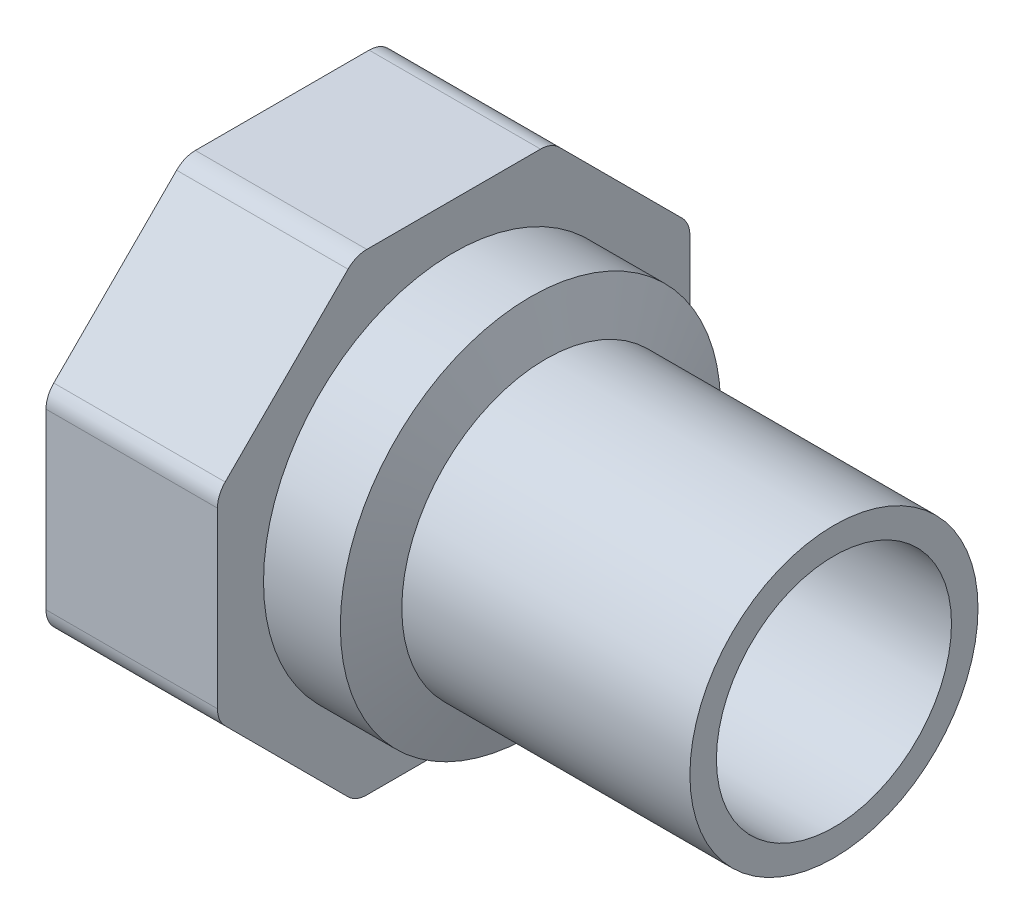
ISO-10303-21;
HEADER;
FILE_DESCRIPTION(('STEP AP214'),'2;1');
FILE_NAME('part.step','',(''),(''),'','','');
FILE_SCHEMA(('AUTOMOTIVE_DESIGN { 1 0 10303 214 1 1 1 1 }'));
ENDSEC;
DATA;
#1=APPLICATION_CONTEXT('core data for automotive mechanical design processes');
#2=APPLICATION_PROTOCOL_DEFINITION('international standard','automotive_design',2000,#1);
#3=PRODUCT_CONTEXT('',#1,'mechanical');
#4=PRODUCT('Part','Part','',(#3));
#5=PRODUCT_RELATED_PRODUCT_CATEGORY('part','',(#4));
#6=PRODUCT_DEFINITION_FORMATION('','',#4);
#7=PRODUCT_DEFINITION_CONTEXT('part definition',#1,'design');
#8=PRODUCT_DEFINITION('design','',#6,#7);
#9=PRODUCT_DEFINITION_SHAPE('','',#8);
#10=(LENGTH_UNIT() NAMED_UNIT(*) SI_UNIT(.MILLI.,.METRE.));
#11=(NAMED_UNIT(*) PLANE_ANGLE_UNIT() SI_UNIT($,.RADIAN.));
#12=(NAMED_UNIT(*) SI_UNIT($,.STERADIAN.) SOLID_ANGLE_UNIT());
#13=UNCERTAINTY_MEASURE_WITH_UNIT(LENGTH_MEASURE(1.E-05),#10,'distance_accuracy_value','');
#14=(GEOMETRIC_REPRESENTATION_CONTEXT(3) GLOBAL_UNCERTAINTY_ASSIGNED_CONTEXT((#13)) GLOBAL_UNIT_ASSIGNED_CONTEXT((#10,
#11,#12)) REPRESENTATION_CONTEXT('',''));
#15=CARTESIAN_POINT('',(0.,0.,0.));
#16=DIRECTION('',(0.,0.,1.));
#17=DIRECTION('',(1.,0.,0.));
#18=AXIS2_PLACEMENT_3D('',#15,#16,#17);
#19=CARTESIAN_POINT('',(-25.,0.,0.));
#20=DIRECTION('',(-1.,0.,0.));
#21=DIRECTION('',(0.,0.,1.));
#22=AXIS2_PLACEMENT_3D('',#19,#20,#21);
#23=CYLINDRICAL_SURFACE('',#22,12.5);
#24=CARTESIAN_POINT('',(-25.,0.,0.));
#25=DIRECTION('',(1.,0.,0.));
#26=DIRECTION('',(0.,1.,0.));
#27=AXIS2_PLACEMENT_3D('',#24,#25,#26);
#28=CIRCLE('',#27,12.5);
#29=CARTESIAN_POINT('',(-25.,12.5,0.));
#30=VERTEX_POINT('',#29);
#31=EDGE_CURVE('E193',#30,#30,#28,.F.);
#32=ORIENTED_EDGE('',*,*,#31,.F.);
#33=EDGE_LOOP('',(#32));
#34=FACE_BOUND('',#33,.T.);
#35=CARTESIAN_POINT('',(0.,0.,0.));
#36=DIRECTION('',(-1.,0.,0.));
#37=DIRECTION('',(0.,0.,1.));
#38=AXIS2_PLACEMENT_3D('',#35,#36,#37);
#39=CIRCLE('',#38,12.5);
#40=CARTESIAN_POINT('',(0.,0.,12.5));
#41=VERTEX_POINT('',#40);
#42=EDGE_CURVE('E18',#41,#41,#39,.F.);
#43=ORIENTED_EDGE('',*,*,#42,.F.);
#44=EDGE_LOOP('',(#43));
#45=FACE_BOUND('',#44,.T.);
#46=ADVANCED_FACE('F15',(#34,#45),#23,.T.);
#47=CARTESIAN_POINT('',(-25.,0.,0.));
#48=DIRECTION('',(-1.,0.,0.));
#49=DIRECTION('',(0.,0.,1.));
#50=AXIS2_PLACEMENT_3D('',#47,#48,#49);
#51=CONICAL_SURFACE('',#50,12.5,1.24904577239826);
#52=CARTESIAN_POINT('',(-26.3333333333333,0.,0.));
#53=DIRECTION('',(-1.,0.,0.));
#54=DIRECTION('',(0.,1.,0.));
#55=AXIS2_PLACEMENT_3D('',#52,#53,#54);
#56=CIRCLE('',#55,16.5);
#57=CARTESIAN_POINT('',(-26.3333333333333,16.5,0.));
#58=VERTEX_POINT('',#57);
#59=EDGE_CURVE('E189',#58,#58,#56,.T.);
#60=ORIENTED_EDGE('',*,*,#59,.F.);
#61=EDGE_LOOP('',(#60));
#62=FACE_BOUND('',#61,.T.);
#63=ORIENTED_EDGE('',*,*,#31,.T.);
#64=EDGE_LOOP('',(#63));
#65=FACE_BOUND('',#64,.T.);
#66=ADVANCED_FACE('F268',(#62,#65),#51,.T.);
#67=CARTESIAN_POINT('',(0.,12.5,12.6500021083112));
#68=DIRECTION('',(1.,0.,0.));
#69=DIRECTION('',(0.,-1.,0.));
#70=AXIS2_PLACEMENT_3D('',#67,#68,#69);
#71=PLANE('',#70);
#72=CARTESIAN_POINT('',(0.,0.,0.));
#73=DIRECTION('',(-1.,0.,0.));
#74=DIRECTION('',(0.,0.,1.));
#75=AXIS2_PLACEMENT_3D('',#72,#73,#74);
#76=CIRCLE('',#75,10.2);
#77=CARTESIAN_POINT('',(0.,0.,10.2));
#78=VERTEX_POINT('',#77);
#79=EDGE_CURVE('E192',#78,#78,#76,.F.);
#80=ORIENTED_EDGE('',*,*,#79,.F.);
#81=EDGE_LOOP('',(#80));
#82=FACE_BOUND('',#81,.T.);
#83=ORIENTED_EDGE('',*,*,#42,.T.);
#84=EDGE_LOOP('',(#83));
#85=FACE_BOUND('',#84,.T.);
#86=ADVANCED_FACE('F264',(#82,#85),#71,.T.);
#87=CARTESIAN_POINT('',(-33.,0.,0.));
#88=DIRECTION('',(-1.,0.,0.));
#89=DIRECTION('',(0.,0.,1.));
#90=AXIS2_PLACEMENT_3D('',#87,#88,#89);
#91=CYLINDRICAL_SURFACE('',#90,16.5);
#92=CARTESIAN_POINT('',(-33.,0.,0.));
#93=DIRECTION('',(-1.,0.,0.));
#94=DIRECTION('',(0.,0.,1.));
#95=AXIS2_PLACEMENT_3D('',#92,#93,#94);
#96=CIRCLE('',#95,16.5);
#97=CARTESIAN_POINT('',(-33.,0.,16.5));
#98=VERTEX_POINT('',#97);
#99=EDGE_CURVE('E188',#98,#98,#96,.T.);
#100=ORIENTED_EDGE('',*,*,#99,.F.);
#101=EDGE_LOOP('',(#100));
#102=FACE_BOUND('',#101,.T.);
#103=ORIENTED_EDGE('',*,*,#59,.T.);
#104=EDGE_LOOP('',(#103));
#105=FACE_BOUND('',#104,.T.);
#106=ADVANCED_FACE('F267',(#102,#105),#91,.T.);
#107=CARTESIAN_POINT('',(0.,0.,0.));
#108=DIRECTION('',(-1.,0.,0.));
#109=DIRECTION('',(0.,0.,1.));
#110=AXIS2_PLACEMENT_3D('',#107,#108,#109);
#111=CYLINDRICAL_SURFACE('',#110,10.2);
#112=ORIENTED_EDGE('',*,*,#79,.T.);
#113=EDGE_LOOP('',(#112));
#114=FACE_BOUND('',#113,.T.);
#115=CARTESIAN_POINT('',(-32.4792577055102,0.,0.));
#116=DIRECTION('',(1.,0.,0.));
#117=DIRECTION('',(0.,1.,0.));
#118=AXIS2_PLACEMENT_3D('',#115,#116,#117);
#119=CIRCLE('',#118,10.2);
#120=CARTESIAN_POINT('',(-32.4792577055102,10.2,0.));
#121=VERTEX_POINT('',#120);
#122=EDGE_CURVE('E135',#121,#121,#119,.T.);
#123=ORIENTED_EDGE('',*,*,#122,.F.);
#124=EDGE_LOOP('',(#123));
#125=FACE_BOUND('',#124,.T.);
#126=ADVANCED_FACE('F261',(#114,#125),#111,.F.);
#127=CARTESIAN_POINT('',(-33.,20.5,20.5));
#128=DIRECTION('',(1.,0.,0.));
#129=DIRECTION('',(0.,-1.,0.));
#130=AXIS2_PLACEMENT_3D('',#127,#128,#129);
#131=PLANE('',#130);
#132=ORIENTED_EDGE('',*,*,#99,.T.);
#133=EDGE_LOOP('',(#132));
#134=FACE_BOUND('',#133,.T.);
#135=CARTESIAN_POINT('',(-33.,7.53868683519033,18.2));
#136=DIRECTION('',(1.,0.,0.));
#137=DIRECTION('',(0.,0.,-1.));
#138=AXIS2_PLACEMENT_3D('',#135,#136,#137);
#139=CIRCLE('',#138,2.30000000000001);
#140=CARTESIAN_POINT('',(-33.,7.53868683519033,20.5));
#141=VERTEX_POINT('',#140);
#142=CARTESIAN_POINT('',(-33.,9.16503243191939,19.8263455967291));
#143=VERTEX_POINT('',#142);
#144=EDGE_CURVE('E254',#141,#143,#139,.F.);
#145=ORIENTED_EDGE('',*,*,#144,.F.);
#146=DIRECTION('',(0.,1.,0.));
#147=VECTOR('',#146,1.);
#148=CARTESIAN_POINT('',(-33.,0.,20.5));
#149=LINE('',#148,#147);
#150=CARTESIAN_POINT('',(-33.,-7.53868683519032,20.5));
#151=VERTEX_POINT('',#150);
#152=EDGE_CURVE('E132',#151,#141,#149,.T.);
#153=ORIENTED_EDGE('',*,*,#152,.F.);
#154=CARTESIAN_POINT('',(-33.,-7.53868683519032,18.2));
#155=DIRECTION('',(1.,0.,0.));
#156=DIRECTION('',(0.,0.,-1.));
#157=AXIS2_PLACEMENT_3D('',#154,#155,#156);
#158=CIRCLE('',#157,2.30000000000001);
#159=CARTESIAN_POINT('',(-33.,-9.16503243191939,19.8263455967291));
#160=VERTEX_POINT('',#159);
#161=EDGE_CURVE('E126',#160,#151,#158,.F.);
#162=ORIENTED_EDGE('',*,*,#161,.F.);
#163=DIRECTION('',(0.,0.707106781186547,0.707106781186548));
#164=VECTOR('',#163,1.);
#165=CARTESIAN_POINT('',(-33.,-14.4956890143242,14.4956890143242));
#166=LINE('',#165,#164);
#167=CARTESIAN_POINT('',(-33.,-19.8263455967291,9.16503243191936));
#168=VERTEX_POINT('',#167);
#169=EDGE_CURVE('E130',#168,#160,#166,.T.);
#170=ORIENTED_EDGE('',*,*,#169,.F.);
#171=CARTESIAN_POINT('',(-33.,-18.2,7.5386868351903));
#172=DIRECTION('',(1.,0.,0.));
#173=DIRECTION('',(0.,0.,-1.));
#174=AXIS2_PLACEMENT_3D('',#171,#172,#173);
#175=CIRCLE('',#174,2.30000000000002);
#176=CARTESIAN_POINT('',(-33.,-20.5,7.5386868351903));
#177=VERTEX_POINT('',#176);
#178=EDGE_CURVE('E149',#177,#168,#175,.F.);
#179=ORIENTED_EDGE('',*,*,#178,.F.);
#180=DIRECTION('',(0.,0.,1.));
#181=VECTOR('',#180,1.);
#182=CARTESIAN_POINT('',(-33.,-20.5,0.));
#183=LINE('',#182,#181);
#184=CARTESIAN_POINT('',(-33.,-20.5,-7.53868683519034));
#185=VERTEX_POINT('',#184);
#186=EDGE_CURVE('E154',#185,#177,#183,.T.);
#187=ORIENTED_EDGE('',*,*,#186,.F.);
#188=CARTESIAN_POINT('',(-33.,-18.2,-7.53868683519034));
#189=DIRECTION('',(1.,0.,0.));
#190=DIRECTION('',(0.,0.,-1.));
#191=AXIS2_PLACEMENT_3D('',#188,#189,#190);
#192=CIRCLE('',#191,2.29999999999999);
#193=CARTESIAN_POINT('',(-33.,-19.8263455967291,-9.1650324319194));
#194=VERTEX_POINT('',#193);
#195=EDGE_CURVE('E239',#194,#185,#192,.F.);
#196=ORIENTED_EDGE('',*,*,#195,.F.);
#197=DIRECTION('',(0.,-0.707106781186548,0.707106781186547));
#198=VECTOR('',#197,1.);
#199=CARTESIAN_POINT('',(-33.,-14.4956890143242,-14.4956890143242));
#200=LINE('',#199,#198);
#201=CARTESIAN_POINT('',(-33.,-9.16503243191939,-19.8263455967291));
#202=VERTEX_POINT('',#201);
#203=EDGE_CURVE('E159',#202,#194,#200,.T.);
#204=ORIENTED_EDGE('',*,*,#203,.F.);
#205=CARTESIAN_POINT('',(-33.,-7.53868683519031,-18.2));
#206=DIRECTION('',(1.,0.,0.));
#207=DIRECTION('',(0.,0.,-1.));
#208=AXIS2_PLACEMENT_3D('',#205,#206,#207);
#209=CIRCLE('',#208,2.30000000000002);
#210=CARTESIAN_POINT('',(-33.,-7.53868683519032,-20.5));
#211=VERTEX_POINT('',#210);
#212=EDGE_CURVE('E242',#211,#202,#209,.F.);
#213=ORIENTED_EDGE('',*,*,#212,.F.);
#214=DIRECTION('',(0.,-1.,0.));
#215=VECTOR('',#214,1.);
#216=CARTESIAN_POINT('',(-33.,0.,-20.5));
#217=LINE('',#216,#215);
#218=CARTESIAN_POINT('',(-33.,7.53868683519033,-20.5));
#219=VERTEX_POINT('',#218);
#220=EDGE_CURVE('E164',#219,#211,#217,.T.);
#221=ORIENTED_EDGE('',*,*,#220,.F.);
#222=CARTESIAN_POINT('',(-33.,7.53868683519032,-18.2));
#223=DIRECTION('',(1.,0.,0.));
#224=DIRECTION('',(0.,0.,-1.));
#225=AXIS2_PLACEMENT_3D('',#222,#223,#224);
#226=CIRCLE('',#225,2.3);
#227=CARTESIAN_POINT('',(-33.,9.16503243191938,-19.8263455967291));
#228=VERTEX_POINT('',#227);
#229=EDGE_CURVE('E245',#228,#219,#226,.F.);
#230=ORIENTED_EDGE('',*,*,#229,.F.);
#231=DIRECTION('',(0.,-0.707106781186547,-0.707106781186548));
#232=VECTOR('',#231,1.);
#233=CARTESIAN_POINT('',(-33.,14.4956890143242,-14.4956890143242));
#234=LINE('',#233,#232);
#235=CARTESIAN_POINT('',(-33.,19.8263455967291,-9.16503243191937));
#236=VERTEX_POINT('',#235);
#237=EDGE_CURVE('E169',#236,#228,#234,.T.);
#238=ORIENTED_EDGE('',*,*,#237,.F.);
#239=CARTESIAN_POINT('',(-33.,18.2,-7.53868683519031));
#240=DIRECTION('',(1.,0.,0.));
#241=DIRECTION('',(0.,0.,-1.));
#242=AXIS2_PLACEMENT_3D('',#239,#240,#241);
#243=CIRCLE('',#242,2.3);
#244=CARTESIAN_POINT('',(-33.,20.5,-7.53868683519031));
#245=VERTEX_POINT('',#244);
#246=EDGE_CURVE('E248',#245,#236,#243,.F.);
#247=ORIENTED_EDGE('',*,*,#246,.F.);
#248=DIRECTION('',(0.,0.,-1.));
#249=VECTOR('',#248,1.);
#250=CARTESIAN_POINT('',(-33.,20.5,0.));
#251=LINE('',#250,#249);
#252=CARTESIAN_POINT('',(-33.,20.5,7.53868683519033));
#253=VERTEX_POINT('',#252);
#254=EDGE_CURVE('E174',#253,#245,#251,.T.);
#255=ORIENTED_EDGE('',*,*,#254,.F.);
#256=CARTESIAN_POINT('',(-33.,18.2,7.53868683519033));
#257=DIRECTION('',(1.,0.,0.));
#258=DIRECTION('',(0.,0.,-1.));
#259=AXIS2_PLACEMENT_3D('',#256,#257,#258);
#260=CIRCLE('',#259,2.3);
#261=CARTESIAN_POINT('',(-33.,19.8263455967291,9.16503243191939));
#262=VERTEX_POINT('',#261);
#263=EDGE_CURVE('E251',#262,#253,#260,.F.);
#264=ORIENTED_EDGE('',*,*,#263,.F.);
#265=DIRECTION('',(0.,0.707106781186547,-0.707106781186547));
#266=VECTOR('',#265,1.);
#267=CARTESIAN_POINT('',(-33.,14.4956890143242,14.4956890143242));
#268=LINE('',#267,#266);
#269=EDGE_CURVE('E179',#143,#262,#268,.T.);
#270=ORIENTED_EDGE('',*,*,#269,.F.);
#271=EDGE_LOOP('',(#145,#153,#162,#170,#179,#187,#196,#204,#213,#221,#230,#238,#247,#255,#264,#270));
#272=FACE_BOUND('',#271,.T.);
#273=ADVANCED_FACE('F128',(#134,#272),#131,.T.);
#274=CARTESIAN_POINT('',(-33.,0.,0.));
#275=DIRECTION('',(-1.,0.,0.));
#276=DIRECTION('',(0.,0.,1.));
#277=AXIS2_PLACEMENT_3D('',#274,#275,#276);
#278=CONICAL_SURFACE('',#277,11.1019521117064,1.0471975511966);
#279=ORIENTED_EDGE('',*,*,#122,.T.);
#280=EDGE_LOOP('',(#279));
#281=FACE_BOUND('',#280,.T.);
#282=CARTESIAN_POINT('',(-33.,0.,0.));
#283=DIRECTION('',(1.,0.,0.));
#284=DIRECTION('',(0.,1.,0.));
#285=AXIS2_PLACEMENT_3D('',#282,#283,#284);
#286=CIRCLE('',#285,11.1019521117064);
#287=CARTESIAN_POINT('',(-33.,11.1019521117064,0.));
#288=VERTEX_POINT('',#287);
#289=EDGE_CURVE('E153',#288,#288,#286,.T.);
#290=ORIENTED_EDGE('',*,*,#289,.F.);
#291=EDGE_LOOP('',(#290));
#292=FACE_BOUND('',#291,.T.);
#293=ADVANCED_FACE('F438',(#281,#292),#278,.F.);
#294=CARTESIAN_POINT('',(-33.,-7.53868683519032,18.2));
#295=DIRECTION('',(1.,0.,0.));
#296=DIRECTION('',(0.,0.,-1.));
#297=AXIS2_PLACEMENT_3D('',#294,#295,#296);
#298=CYLINDRICAL_SURFACE('',#297,2.30000000000001);
#299=CARTESIAN_POINT('',(-47.875,-7.53868683519032,18.2));
#300=DIRECTION('',(1.,0.,0.));
#301=DIRECTION('',(0.,0.,-1.));
#302=AXIS2_PLACEMENT_3D('',#299,#300,#301);
#303=CIRCLE('',#302,2.30000000000001);
#304=CARTESIAN_POINT('',(-47.875,-9.16503243191938,19.8263455967291));
#305=VERTEX_POINT('',#304);
#306=CARTESIAN_POINT('',(-47.875,-7.53868683519032,20.5));
#307=VERTEX_POINT('',#306);
#308=EDGE_CURVE('E141',#305,#307,#303,.F.);
#309=ORIENTED_EDGE('',*,*,#308,.F.);
#310=DIRECTION('',(1.,0.,0.));
#311=VECTOR('',#310,1.);
#312=CARTESIAN_POINT('',(-47.875,-9.16503243191938,19.8263455967291));
#313=LINE('',#312,#311);
#314=EDGE_CURVE('E138',#160,#305,#313,.F.);
#315=ORIENTED_EDGE('',*,*,#314,.F.);
#316=ORIENTED_EDGE('',*,*,#161,.T.);
#317=DIRECTION('',(1.,0.,0.));
#318=VECTOR('',#317,1.);
#319=CARTESIAN_POINT('',(-47.875,-7.53868683519032,20.5));
#320=LINE('',#319,#318);
#321=EDGE_CURVE('E185',#307,#151,#320,.T.);
#322=ORIENTED_EDGE('',*,*,#321,.F.);
#323=EDGE_LOOP('',(#309,#315,#316,#322));
#324=FACE_BOUND('',#323,.T.);
#325=ADVANCED_FACE('F139',(#324),#298,.T.);
#326=CARTESIAN_POINT('',(-47.875,7.53868683519033,20.5));
#327=DIRECTION('',(0.,0.,1.));
#328=DIRECTION('',(0.,-1.,0.));
#329=AXIS2_PLACEMENT_3D('',#326,#327,#328);
#330=PLANE('',#329);
#331=DIRECTION('',(0.,1.,0.));
#332=VECTOR('',#331,1.);
#333=CARTESIAN_POINT('',(-47.875,0.,20.5));
#334=LINE('',#333,#332);
#335=CARTESIAN_POINT('',(-47.875,7.53868683519033,20.5));
#336=VERTEX_POINT('',#335);
#337=EDGE_CURVE('E236',#307,#336,#334,.T.);
#338=ORIENTED_EDGE('',*,*,#337,.F.);
#339=ORIENTED_EDGE('',*,*,#321,.T.);
#340=ORIENTED_EDGE('',*,*,#152,.T.);
#341=DIRECTION('',(1.,0.,0.));
#342=VECTOR('',#341,1.);
#343=CARTESIAN_POINT('',(-40.4375,7.53868683519033,20.5));
#344=LINE('',#343,#342);
#345=EDGE_CURVE('E183',#336,#141,#344,.T.);
#346=ORIENTED_EDGE('',*,*,#345,.F.);
#347=EDGE_LOOP('',(#338,#339,#340,#346));
#348=FACE_BOUND('',#347,.T.);
#349=ADVANCED_FACE('F387',(#348),#330,.T.);
#350=CARTESIAN_POINT('',(-33.,7.53868683519033,18.2));
#351=DIRECTION('',(1.,0.,0.));
#352=DIRECTION('',(0.,0.,-1.));
#353=AXIS2_PLACEMENT_3D('',#350,#351,#352);
#354=CYLINDRICAL_SURFACE('',#353,2.30000000000001);
#355=CARTESIAN_POINT('',(-47.875,7.53868683519033,18.2));
#356=DIRECTION('',(1.,0.,0.));
#357=DIRECTION('',(0.,0.,-1.));
#358=AXIS2_PLACEMENT_3D('',#355,#356,#357);
#359=CIRCLE('',#358,2.30000000000001);
#360=CARTESIAN_POINT('',(-47.875,9.16503243191939,19.8263455967291));
#361=VERTEX_POINT('',#360);
#362=EDGE_CURVE('E233',#336,#361,#359,.F.);
#363=ORIENTED_EDGE('',*,*,#362,.F.);
#364=ORIENTED_EDGE('',*,*,#345,.T.);
#365=ORIENTED_EDGE('',*,*,#144,.T.);
#366=DIRECTION('',(1.,0.,0.));
#367=VECTOR('',#366,1.);
#368=CARTESIAN_POINT('',(-47.875,9.16503243191939,19.8263455967291));
#369=LINE('',#368,#367);
#370=EDGE_CURVE('E182',#361,#143,#369,.T.);
#371=ORIENTED_EDGE('',*,*,#370,.F.);
#372=EDGE_LOOP('',(#363,#364,#365,#371));
#373=FACE_BOUND('',#372,.T.);
#374=ADVANCED_FACE('F425',(#373),#354,.T.);
#375=CARTESIAN_POINT('',(-47.875,19.8263455967291,9.16503243191939));
#376=DIRECTION('',(0.,0.707106781186547,0.707106781186547));
#377=DIRECTION('',(0.,-0.707106781186547,0.707106781186547));
#378=AXIS2_PLACEMENT_3D('',#375,#376,#377);
#379=PLANE('',#378);
#380=CARTESIAN_POINT('',(-47.875,9.16503243191939,19.8263455967291));
#381=CARTESIAN_POINT('',(-47.875,9.60925381378646,19.382124214862));
#382=CARTESIAN_POINT('',(-47.875,10.0534751956535,18.9379028329949));
#383=CARTESIAN_POINT('',(-47.875,10.9419179593877,18.0494600692608));
#384=CARTESIAN_POINT('',(-47.875,11.3861393412547,17.6052386873937));
#385=CARTESIAN_POINT('',(-47.875,12.2745821049889,16.7167959236596));
#386=CARTESIAN_POINT('',(-47.875,12.7188034868559,16.2725745417925));
#387=CARTESIAN_POINT('',(-47.875,13.6072462505901,15.3841317780584));
#388=CARTESIAN_POINT('',(-47.875,14.0514676324572,14.9399103961913));
#389=CARTESIAN_POINT('',(-47.875,14.9399103961913,14.0514676324572));
#390=CARTESIAN_POINT('',(-47.875,15.3841317780584,13.6072462505901));
#391=CARTESIAN_POINT('',(-47.875,16.2725745417925,12.7188034868559));
#392=CARTESIAN_POINT('',(-47.875,16.7167959236596,12.2745821049889));
#393=CARTESIAN_POINT('',(-47.875,17.6052386873937,11.3861393412547));
#394=CARTESIAN_POINT('',(-47.875,18.0494600692608,10.9419179593877));
#395=CARTESIAN_POINT('',(-47.875,18.9379028329949,10.0534751956535));
#396=CARTESIAN_POINT('',(-47.875,19.382124214862,9.60925381378646));
#397=CARTESIAN_POINT('',(-47.875,19.8263455967291,9.16503243191939));
#398=B_SPLINE_CURVE_WITH_KNOTS('',3,(#380,#381,#382,#383,#384,#385,#386,#387,#388,#389,#390,
#391,#392,#393,#394,#395,#396,#397),.UNSPECIFIED.,.F.,.F.,(4,2,2,2,2,2,2,2,4),(0.,
1.88467170879758,3.76934341759516,5.65401512639274,7.53868683519033,9.42335854398791,
11.3080302527855,13.1927019615831,15.0773736703807),.UNSPECIFIED.);
#399=CARTESIAN_POINT('',(-47.875,19.8263455967291,9.16503243191939));
#400=VERTEX_POINT('',#399);
#401=EDGE_CURVE('E232',#361,#400,#398,.T.);
#402=ORIENTED_EDGE('',*,*,#401,.F.);
#403=ORIENTED_EDGE('',*,*,#370,.T.);
#404=ORIENTED_EDGE('',*,*,#269,.T.);
#405=DIRECTION('',(1.,0.,0.));
#406=VECTOR('',#405,1.);
#407=CARTESIAN_POINT('',(-40.4375,19.8263455967291,9.16503243191939));
#408=LINE('',#407,#406);
#409=EDGE_CURVE('E178',#400,#262,#408,.T.);
#410=ORIENTED_EDGE('',*,*,#409,.F.);
#411=EDGE_LOOP('',(#402,#403,#404,#410));
#412=FACE_BOUND('',#411,.T.);
#413=ADVANCED_FACE('F423',(#412),#379,.T.);
#414=CARTESIAN_POINT('',(-33.,18.2,7.53868683519033));
#415=DIRECTION('',(1.,0.,0.));
#416=DIRECTION('',(0.,0.,-1.));
#417=AXIS2_PLACEMENT_3D('',#414,#415,#416);
#418=CYLINDRICAL_SURFACE('',#417,2.3);
#419=CARTESIAN_POINT('',(-47.875,18.2,7.53868683519033));
#420=DIRECTION('',(1.,0.,0.));
#421=DIRECTION('',(0.,0.,-1.));
#422=AXIS2_PLACEMENT_3D('',#419,#420,#421);
#423=CIRCLE('',#422,2.3);
#424=CARTESIAN_POINT('',(-47.875,20.5,7.53868683519033));
#425=VERTEX_POINT('',#424);
#426=EDGE_CURVE('E229',#400,#425,#423,.F.);
#427=ORIENTED_EDGE('',*,*,#426,.F.);
#428=ORIENTED_EDGE('',*,*,#409,.T.);
#429=ORIENTED_EDGE('',*,*,#263,.T.);
#430=DIRECTION('',(1.,0.,0.));
#431=VECTOR('',#430,1.);
#432=CARTESIAN_POINT('',(-47.875,20.5,7.53868683519033));
#433=LINE('',#432,#431);
#434=EDGE_CURVE('E177',#425,#253,#433,.T.);
#435=ORIENTED_EDGE('',*,*,#434,.F.);
#436=EDGE_LOOP('',(#427,#428,#429,#435));
#437=FACE_BOUND('',#436,.T.);
#438=ADVANCED_FACE('F420',(#437),#418,.T.);
#439=CARTESIAN_POINT('',(-47.875,20.5,-7.53868683519031));
#440=DIRECTION('',(0.,1.,0.));
#441=DIRECTION('',(0.,0.,1.));
#442=AXIS2_PLACEMENT_3D('',#439,#440,#441);
#443=PLANE('',#442);
#444=DIRECTION('',(0.,0.,-1.));
#445=VECTOR('',#444,1.);
#446=CARTESIAN_POINT('',(-47.875,20.5,20.5));
#447=LINE('',#446,#445);
#448=CARTESIAN_POINT('',(-47.875,20.5,-7.53868683519031));
#449=VERTEX_POINT('',#448);
#450=EDGE_CURVE('E228',#425,#449,#447,.T.);
#451=ORIENTED_EDGE('',*,*,#450,.F.);
#452=ORIENTED_EDGE('',*,*,#434,.T.);
#453=ORIENTED_EDGE('',*,*,#254,.T.);
#454=DIRECTION('',(1.,0.,0.));
#455=VECTOR('',#454,1.);
#456=CARTESIAN_POINT('',(-40.4375,20.5,-7.53868683519031));
#457=LINE('',#456,#455);
#458=EDGE_CURVE('E173',#449,#245,#457,.T.);
#459=ORIENTED_EDGE('',*,*,#458,.F.);
#460=EDGE_LOOP('',(#451,#452,#453,#459));
#461=FACE_BOUND('',#460,.T.);
#462=ADVANCED_FACE('F417',(#461),#443,.T.);
#463=CARTESIAN_POINT('',(-33.,18.2,-7.53868683519031));
#464=DIRECTION('',(1.,0.,0.));
#465=DIRECTION('',(0.,0.,-1.));
#466=AXIS2_PLACEMENT_3D('',#463,#464,#465);
#467=CYLINDRICAL_SURFACE('',#466,2.3);
#468=CARTESIAN_POINT('',(-47.875,18.2,-7.53868683519031));
#469=DIRECTION('',(1.,0.,0.));
#470=DIRECTION('',(0.,0.,-1.));
#471=AXIS2_PLACEMENT_3D('',#468,#469,#470);
#472=CIRCLE('',#471,2.3);
#473=CARTESIAN_POINT('',(-47.875,19.8263455967291,-9.16503243191937));
#474=VERTEX_POINT('',#473);
#475=EDGE_CURVE('E225',#449,#474,#472,.F.);
#476=ORIENTED_EDGE('',*,*,#475,.F.);
#477=ORIENTED_EDGE('',*,*,#458,.T.);
#478=ORIENTED_EDGE('',*,*,#246,.T.);
#479=DIRECTION('',(1.,0.,0.));
#480=VECTOR('',#479,1.);
#481=CARTESIAN_POINT('',(-47.875,19.8263455967291,-9.16503243191937));
#482=LINE('',#481,#480);
#483=EDGE_CURVE('E172',#474,#236,#482,.T.);
#484=ORIENTED_EDGE('',*,*,#483,.F.);
#485=EDGE_LOOP('',(#476,#477,#478,#484));
#486=FACE_BOUND('',#485,.T.);
#487=ADVANCED_FACE('F414',(#486),#467,.T.);
#488=CARTESIAN_POINT('',(-47.875,9.16503243191938,-19.8263455967291));
#489=DIRECTION('',(0.,0.707106781186548,-0.707106781186547));
#490=DIRECTION('',(0.,0.707106781186547,0.707106781186548));
#491=AXIS2_PLACEMENT_3D('',#488,#489,#490);
#492=PLANE('',#491);
#493=CARTESIAN_POINT('',(-47.875,19.8263455967291,-9.16503243191937));
#494=CARTESIAN_POINT('',(-47.875,19.382124214862,-9.60925381378644));
#495=CARTESIAN_POINT('',(-47.875,18.9379028329949,-10.0534751956535));
#496=CARTESIAN_POINT('',(-47.875,18.0494600692608,-10.9419179593877));
#497=CARTESIAN_POINT('',(-47.875,17.6052386873937,-11.3861393412547));
#498=CARTESIAN_POINT('',(-47.875,16.7167959236596,-12.2745821049889));
#499=CARTESIAN_POINT('',(-47.875,16.2725745417925,-12.7188034868559));
#500=CARTESIAN_POINT('',(-47.875,15.3841317780584,-13.6072462505901));
#501=CARTESIAN_POINT('',(-47.875,14.9399103961913,-14.0514676324571));
#502=CARTESIAN_POINT('',(-47.875,14.0514676324571,-14.9399103961913));
#503=CARTESIAN_POINT('',(-47.875,13.6072462505901,-15.3841317780584));
#504=CARTESIAN_POINT('',(-47.875,12.7188034868559,-16.2725745417925));
#505=CARTESIAN_POINT('',(-47.875,12.2745821049889,-16.7167959236596));
#506=CARTESIAN_POINT('',(-47.875,11.3861393412547,-17.6052386873937));
#507=CARTESIAN_POINT('',(-47.875,10.9419179593877,-18.0494600692608));
#508=CARTESIAN_POINT('',(-47.875,10.0534751956535,-18.9379028329949));
#509=CARTESIAN_POINT('',(-47.875,9.60925381378645,-19.382124214862));
#510=CARTESIAN_POINT('',(-47.875,9.16503243191938,-19.8263455967291));
#511=B_SPLINE_CURVE_WITH_KNOTS('',3,(#493,#494,#495,#496,#497,#498,#499,#500,#501,#502,#503,
#504,#505,#506,#507,#508,#509,#510),.UNSPECIFIED.,.F.,.F.,(4,2,2,2,2,2,2,2,4),(0.,
1.88467170879759,3.76934341759517,5.65401512639276,7.53868683519034,9.42335854398792,
11.3080302527855,13.1927019615831,15.0773736703807),.UNSPECIFIED.);
#512=CARTESIAN_POINT('',(-47.875,9.16503243191938,-19.8263455967291));
#513=VERTEX_POINT('',#512);
#514=EDGE_CURVE('E224',#474,#513,#511,.T.);
#515=ORIENTED_EDGE('',*,*,#514,.F.);
#516=ORIENTED_EDGE('',*,*,#483,.T.);
#517=ORIENTED_EDGE('',*,*,#237,.T.);
#518=DIRECTION('',(1.,0.,0.));
#519=VECTOR('',#518,1.);
#520=CARTESIAN_POINT('',(-40.4375,9.16503243191938,-19.8263455967291));
#521=LINE('',#520,#519);
#522=EDGE_CURVE('E168',#513,#228,#521,.T.);
#523=ORIENTED_EDGE('',*,*,#522,.F.);
#524=EDGE_LOOP('',(#515,#516,#517,#523));
#525=FACE_BOUND('',#524,.T.);
#526=ADVANCED_FACE('F411',(#525),#492,.T.);
#527=CARTESIAN_POINT('',(-33.,7.53868683519032,-18.2));
#528=DIRECTION('',(1.,0.,0.));
#529=DIRECTION('',(0.,0.,-1.));
#530=AXIS2_PLACEMENT_3D('',#527,#528,#529);
#531=CYLINDRICAL_SURFACE('',#530,2.3);
#532=CARTESIAN_POINT('',(-47.875,7.53868683519032,-18.2));
#533=DIRECTION('',(1.,0.,0.));
#534=DIRECTION('',(0.,0.,-1.));
#535=AXIS2_PLACEMENT_3D('',#532,#533,#534);
#536=CIRCLE('',#535,2.3);
#537=CARTESIAN_POINT('',(-47.875,7.53868683519033,-20.5));
#538=VERTEX_POINT('',#537);
#539=EDGE_CURVE('E221',#513,#538,#536,.F.);
#540=ORIENTED_EDGE('',*,*,#539,.F.);
#541=ORIENTED_EDGE('',*,*,#522,.T.);
#542=ORIENTED_EDGE('',*,*,#229,.T.);
#543=DIRECTION('',(1.,0.,0.));
#544=VECTOR('',#543,1.);
#545=CARTESIAN_POINT('',(-47.875,7.53868683519033,-20.5));
#546=LINE('',#545,#544);
#547=EDGE_CURVE('E167',#538,#219,#546,.T.);
#548=ORIENTED_EDGE('',*,*,#547,.F.);
#549=EDGE_LOOP('',(#540,#541,#542,#548));
#550=FACE_BOUND('',#549,.T.);
#551=ADVANCED_FACE('F408',(#550),#531,.T.);
#552=CARTESIAN_POINT('',(-47.875,-7.53868683519032,-20.5));
#553=DIRECTION('',(0.,0.,-1.));
#554=DIRECTION('',(0.,1.,0.));
#555=AXIS2_PLACEMENT_3D('',#552,#553,#554);
#556=PLANE('',#555);
#557=DIRECTION('',(0.,-1.,0.));
#558=VECTOR('',#557,1.);
#559=CARTESIAN_POINT('',(-47.875,0.,-20.5));
#560=LINE('',#559,#558);
#561=CARTESIAN_POINT('',(-47.875,-7.53868683519032,-20.5));
#562=VERTEX_POINT('',#561);
#563=EDGE_CURVE('E220',#538,#562,#560,.T.);
#564=ORIENTED_EDGE('',*,*,#563,.F.);
#565=ORIENTED_EDGE('',*,*,#547,.T.);
#566=ORIENTED_EDGE('',*,*,#220,.T.);
#567=DIRECTION('',(1.,0.,0.));
#568=VECTOR('',#567,1.);
#569=CARTESIAN_POINT('',(-40.4375,-7.53868683519032,-20.5));
#570=LINE('',#569,#568);
#571=EDGE_CURVE('E163',#562,#211,#570,.T.);
#572=ORIENTED_EDGE('',*,*,#571,.F.);
#573=EDGE_LOOP('',(#564,#565,#566,#572));
#574=FACE_BOUND('',#573,.T.);
#575=ADVANCED_FACE('F405',(#574),#556,.T.);
#576=CARTESIAN_POINT('',(-33.,-7.53868683519031,-18.2));
#577=DIRECTION('',(1.,0.,0.));
#578=DIRECTION('',(0.,0.,-1.));
#579=AXIS2_PLACEMENT_3D('',#576,#577,#578);
#580=CYLINDRICAL_SURFACE('',#579,2.30000000000002);
#581=CARTESIAN_POINT('',(-47.875,-7.53868683519031,-18.2));
#582=DIRECTION('',(1.,0.,0.));
#583=DIRECTION('',(0.,0.,-1.));
#584=AXIS2_PLACEMENT_3D('',#581,#582,#583);
#585=CIRCLE('',#584,2.30000000000002);
#586=CARTESIAN_POINT('',(-47.875,-9.16503243191938,-19.8263455967291));
#587=VERTEX_POINT('',#586);
#588=EDGE_CURVE('E217',#562,#587,#585,.F.);
#589=ORIENTED_EDGE('',*,*,#588,.F.);
#590=ORIENTED_EDGE('',*,*,#571,.T.);
#591=ORIENTED_EDGE('',*,*,#212,.T.);
#592=DIRECTION('',(1.,0.,0.));
#593=VECTOR('',#592,1.);
#594=CARTESIAN_POINT('',(-47.875,-9.16503243191938,-19.8263455967291));
#595=LINE('',#594,#593);
#596=EDGE_CURVE('E162',#587,#202,#595,.T.);
#597=ORIENTED_EDGE('',*,*,#596,.F.);
#598=EDGE_LOOP('',(#589,#590,#591,#597));
#599=FACE_BOUND('',#598,.T.);
#600=ADVANCED_FACE('F402',(#599),#580,.T.);
#601=CARTESIAN_POINT('',(-47.875,-19.8263455967291,-9.1650324319194));
#602=DIRECTION('',(0.,-0.707106781186547,-0.707106781186548));
#603=DIRECTION('',(0.,0.707106781186548,-0.707106781186547));
#604=AXIS2_PLACEMENT_3D('',#601,#602,#603);
#605=PLANE('',#604);
#606=CARTESIAN_POINT('',(-47.875,-9.16503243191939,-19.8263455967291));
#607=CARTESIAN_POINT('',(-47.875,-9.60925381378645,-19.382124214862));
#608=CARTESIAN_POINT('',(-47.875,-10.0534751956535,-18.9379028329949));
#609=CARTESIAN_POINT('',(-47.875,-10.9419179593877,-18.0494600692608));
#610=CARTESIAN_POINT('',(-47.875,-11.3861393412547,-17.6052386873937));
#611=CARTESIAN_POINT('',(-47.875,-12.2745821049889,-16.7167959236596));
#612=CARTESIAN_POINT('',(-47.875,-12.7188034868559,-16.2725745417925));
#613=CARTESIAN_POINT('',(-47.875,-13.6072462505901,-15.3841317780584));
#614=CARTESIAN_POINT('',(-47.875,-14.0514676324572,-14.9399103961913));
#615=CARTESIAN_POINT('',(-47.875,-14.9399103961913,-14.0514676324572));
#616=CARTESIAN_POINT('',(-47.875,-15.3841317780584,-13.6072462505901));
#617=CARTESIAN_POINT('',(-47.875,-16.2725745417925,-12.718803486856));
#618=CARTESIAN_POINT('',(-47.875,-16.7167959236596,-12.2745821049889));
#619=CARTESIAN_POINT('',(-47.875,-17.6052386873937,-11.3861393412547));
#620=CARTESIAN_POINT('',(-47.875,-18.0494600692608,-10.9419179593877));
#621=CARTESIAN_POINT('',(-47.875,-18.9379028329949,-10.0534751956535));
#622=CARTESIAN_POINT('',(-47.875,-19.382124214862,-9.60925381378647));
#623=CARTESIAN_POINT('',(-47.875,-19.8263455967291,-9.1650324319194));
#624=B_SPLINE_CURVE_WITH_KNOTS('',3,(#606,#607,#608,#609,#610,#611,#612,#613,#614,#615,#616,
#617,#618,#619,#620,#621,#622,#623),.UNSPECIFIED.,.F.,.F.,(4,2,2,2,2,2,2,2,4),(0.,
1.88467170879758,3.76934341759516,5.65401512639275,7.53868683519033,9.42335854398791,
11.3080302527855,13.1927019615831,15.0773736703807),.UNSPECIFIED.);
#625=CARTESIAN_POINT('',(-47.875,-19.826345596729,-9.1650324319194));
#626=VERTEX_POINT('',#625);
#627=EDGE_CURVE('E216',#587,#626,#624,.T.);
#628=ORIENTED_EDGE('',*,*,#627,.F.);
#629=ORIENTED_EDGE('',*,*,#596,.T.);
#630=ORIENTED_EDGE('',*,*,#203,.T.);
#631=DIRECTION('',(1.,0.,0.));
#632=VECTOR('',#631,1.);
#633=CARTESIAN_POINT('',(-40.4375,-19.826345596729,-9.1650324319194));
#634=LINE('',#633,#632);
#635=EDGE_CURVE('E158',#626,#194,#634,.T.);
#636=ORIENTED_EDGE('',*,*,#635,.F.);
#637=EDGE_LOOP('',(#628,#629,#630,#636));
#638=FACE_BOUND('',#637,.T.);
#639=ADVANCED_FACE('F399',(#638),#605,.T.);
#640=CARTESIAN_POINT('',(-33.,-18.2,-7.53868683519034));
#641=DIRECTION('',(1.,0.,0.));
#642=DIRECTION('',(0.,0.,-1.));
#643=AXIS2_PLACEMENT_3D('',#640,#641,#642);
#644=CYLINDRICAL_SURFACE('',#643,2.29999999999999);
#645=CARTESIAN_POINT('',(-47.875,-18.2,-7.53868683519034));
#646=DIRECTION('',(1.,0.,0.));
#647=DIRECTION('',(0.,0.,-1.));
#648=AXIS2_PLACEMENT_3D('',#645,#646,#647);
#649=CIRCLE('',#648,2.29999999999999);
#650=CARTESIAN_POINT('',(-47.875,-20.5,-7.53868683519034));
#651=VERTEX_POINT('',#650);
#652=EDGE_CURVE('E213',#626,#651,#649,.F.);
#653=ORIENTED_EDGE('',*,*,#652,.F.);
#654=ORIENTED_EDGE('',*,*,#635,.T.);
#655=ORIENTED_EDGE('',*,*,#195,.T.);
#656=DIRECTION('',(1.,0.,0.));
#657=VECTOR('',#656,1.);
#658=CARTESIAN_POINT('',(-47.875,-20.5,-7.53868683519034));
#659=LINE('',#658,#657);
#660=EDGE_CURVE('E157',#651,#185,#659,.T.);
#661=ORIENTED_EDGE('',*,*,#660,.F.);
#662=EDGE_LOOP('',(#653,#654,#655,#661));
#663=FACE_BOUND('',#662,.T.);
#664=ADVANCED_FACE('F396',(#663),#644,.T.);
#665=CARTESIAN_POINT('',(-47.875,-20.5,7.53868683519031));
#666=DIRECTION('',(0.,-1.,0.));
#667=DIRECTION('',(0.,0.,-1.));
#668=AXIS2_PLACEMENT_3D('',#665,#666,#667);
#669=PLANE('',#668);
#670=DIRECTION('',(0.,0.,-1.));
#671=VECTOR('',#670,1.);
#672=CARTESIAN_POINT('',(-47.875,-20.5,20.5));
#673=LINE('',#672,#671);
#674=CARTESIAN_POINT('',(-47.875,-20.5,7.5386868351903));
#675=VERTEX_POINT('',#674);
#676=EDGE_CURVE('E212',#651,#675,#673,.F.);
#677=ORIENTED_EDGE('',*,*,#676,.F.);
#678=ORIENTED_EDGE('',*,*,#660,.T.);
#679=ORIENTED_EDGE('',*,*,#186,.T.);
#680=DIRECTION('',(1.,0.,0.));
#681=VECTOR('',#680,1.);
#682=CARTESIAN_POINT('',(-40.4375,-20.5,7.53868683519031));
#683=LINE('',#682,#681);
#684=EDGE_CURVE('E146',#675,#177,#683,.T.);
#685=ORIENTED_EDGE('',*,*,#684,.F.);
#686=EDGE_LOOP('',(#677,#678,#679,#685));
#687=FACE_BOUND('',#686,.T.);
#688=ADVANCED_FACE('F393',(#687),#669,.T.);
#689=CARTESIAN_POINT('',(-33.,-18.2,7.5386868351903));
#690=DIRECTION('',(1.,0.,0.));
#691=DIRECTION('',(0.,0.,-1.));
#692=AXIS2_PLACEMENT_3D('',#689,#690,#691);
#693=CYLINDRICAL_SURFACE('',#692,2.30000000000002);
#694=CARTESIAN_POINT('',(-47.875,-18.2,7.5386868351903));
#695=DIRECTION('',(1.,0.,0.));
#696=DIRECTION('',(0.,0.,-1.));
#697=AXIS2_PLACEMENT_3D('',#694,#695,#696);
#698=CIRCLE('',#697,2.30000000000002);
#699=CARTESIAN_POINT('',(-47.875,-19.8263455967291,9.16503243191937));
#700=VERTEX_POINT('',#699);
#701=EDGE_CURVE('E208',#675,#700,#698,.F.);
#702=ORIENTED_EDGE('',*,*,#701,.F.);
#703=ORIENTED_EDGE('',*,*,#684,.T.);
#704=ORIENTED_EDGE('',*,*,#178,.T.);
#705=DIRECTION('',(1.,0.,0.));
#706=VECTOR('',#705,1.);
#707=CARTESIAN_POINT('',(-47.875,-19.8263455967291,9.16503243191936));
#708=LINE('',#707,#706);
#709=EDGE_CURVE('E33',#700,#168,#708,.T.);
#710=ORIENTED_EDGE('',*,*,#709,.F.);
#711=EDGE_LOOP('',(#702,#703,#704,#710));
#712=FACE_BOUND('',#711,.T.);
#713=ADVANCED_FACE('F391',(#712),#693,.T.);
#714=CARTESIAN_POINT('',(-47.875,-9.16503243191938,19.8263455967291));
#715=DIRECTION('',(0.,-0.707106781186548,0.707106781186547));
#716=DIRECTION('',(0.,-0.707106781186547,-0.707106781186548));
#717=AXIS2_PLACEMENT_3D('',#714,#715,#716);
#718=PLANE('',#717);
#719=CARTESIAN_POINT('',(-47.875,-19.8263455967291,9.16503243191937));
#720=CARTESIAN_POINT('',(-47.875,-19.382124214862,9.60925381378644));
#721=CARTESIAN_POINT('',(-47.875,-18.9379028329949,10.0534751956535));
#722=CARTESIAN_POINT('',(-47.875,-18.0494600692608,10.9419179593877));
#723=CARTESIAN_POINT('',(-47.875,-17.6052386873937,11.3861393412547));
#724=CARTESIAN_POINT('',(-47.875,-16.7167959236596,12.2745821049889));
#725=CARTESIAN_POINT('',(-47.875,-16.2725745417925,12.7188034868559));
#726=CARTESIAN_POINT('',(-47.875,-15.3841317780584,13.6072462505901));
#727=CARTESIAN_POINT('',(-47.875,-14.9399103961913,14.0514676324571));
#728=CARTESIAN_POINT('',(-47.875,-14.0514676324572,14.9399103961913));
#729=CARTESIAN_POINT('',(-47.875,-13.6072462505901,15.3841317780584));
#730=CARTESIAN_POINT('',(-47.875,-12.718803486856,16.2725745417925));
#731=CARTESIAN_POINT('',(-47.875,-12.2745821049889,16.7167959236596));
#732=CARTESIAN_POINT('',(-47.875,-11.3861393412547,17.6052386873937));
#733=CARTESIAN_POINT('',(-47.875,-10.9419179593877,18.0494600692608));
#734=CARTESIAN_POINT('',(-47.875,-10.0534751956535,18.9379028329949));
#735=CARTESIAN_POINT('',(-47.875,-9.60925381378646,19.382124214862));
#736=CARTESIAN_POINT('',(-47.875,-9.16503243191939,19.8263455967291));
#737=B_SPLINE_CURVE_WITH_KNOTS('',3,(#719,#720,#721,#722,#723,#724,#725,#726,#727,#728,#729,
#730,#731,#732,#733,#734,#735,#736),.UNSPECIFIED.,.F.,.F.,(4,2,2,2,2,2,2,2,4),(0.,
1.88467170879758,3.76934341759517,5.65401512639275,7.53868683519034,9.42335854398792,
11.3080302527855,13.1927019615831,15.0773736703807),.UNSPECIFIED.);
#738=EDGE_CURVE('E211',#700,#305,#737,.T.);
#739=ORIENTED_EDGE('',*,*,#738,.F.);
#740=ORIENTED_EDGE('',*,*,#709,.T.);
#741=ORIENTED_EDGE('',*,*,#169,.T.);
#742=ORIENTED_EDGE('',*,*,#314,.T.);
#743=EDGE_LOOP('',(#739,#740,#741,#742));
#744=FACE_BOUND('',#743,.T.);
#745=ADVANCED_FACE('F145',(#744),#718,.T.);
#746=CARTESIAN_POINT('',(-46.3784123182743,0.,0.));
#747=DIRECTION('',(-1.,0.,0.));
#748=DIRECTION('',(0.,0.,1.));
#749=AXIS2_PLACEMENT_3D('',#746,#747,#748);
#750=CONICAL_SURFACE('',#749,11.5184123182743,0.0311192205630589);
#751=ORIENTED_EDGE('',*,*,#289,.T.);
#752=EDGE_LOOP('',(#751));
#753=FACE_BOUND('',#752,.T.);
#754=CARTESIAN_POINT('',(-46.3784123182743,0.,0.));
#755=DIRECTION('',(1.,0.,0.));
#756=DIRECTION('',(0.,1.,0.));
#757=AXIS2_PLACEMENT_3D('',#754,#755,#756);
#758=CIRCLE('',#757,11.5184123182743);
#759=CARTESIAN_POINT('',(-46.3784123182743,11.5184123182743,0.));
#760=VERTEX_POINT('',#759);
#761=EDGE_CURVE('E207',#760,#760,#758,.T.);
#762=ORIENTED_EDGE('',*,*,#761,.F.);
#763=EDGE_LOOP('',(#762));
#764=FACE_BOUND('',#763,.T.);
#765=ADVANCED_FACE('F560',(#753,#764),#750,.F.);
#766=CARTESIAN_POINT('',(-47.875,-20.5,20.5));
#767=DIRECTION('',(-1.,0.,0.));
#768=DIRECTION('',(0.,1.,0.));
#769=AXIS2_PLACEMENT_3D('',#766,#767,#768);
#770=PLANE('',#769);
#771=CARTESIAN_POINT('',(-47.875,0.,0.));
#772=DIRECTION('',(-1.,0.,0.));
#773=DIRECTION('',(0.,0.,1.));
#774=AXIS2_PLACEMENT_3D('',#771,#772,#773);
#775=CIRCLE('',#774,16.5);
#776=CARTESIAN_POINT('',(-47.875,0.,16.5));
#777=VERTEX_POINT('',#776);
#778=EDGE_CURVE('E204',#777,#777,#775,.T.);
#779=ORIENTED_EDGE('',*,*,#778,.F.);
#780=EDGE_LOOP('',(#779));
#781=FACE_BOUND('',#780,.T.);
#782=ORIENTED_EDGE('',*,*,#701,.T.);
#783=ORIENTED_EDGE('',*,*,#738,.T.);
#784=ORIENTED_EDGE('',*,*,#308,.T.);
#785=ORIENTED_EDGE('',*,*,#337,.T.);
#786=ORIENTED_EDGE('',*,*,#362,.T.);
#787=ORIENTED_EDGE('',*,*,#401,.T.);
#788=ORIENTED_EDGE('',*,*,#426,.T.);
#789=ORIENTED_EDGE('',*,*,#450,.T.);
#790=ORIENTED_EDGE('',*,*,#475,.T.);
#791=ORIENTED_EDGE('',*,*,#514,.T.);
#792=ORIENTED_EDGE('',*,*,#539,.T.);
#793=ORIENTED_EDGE('',*,*,#563,.T.);
#794=ORIENTED_EDGE('',*,*,#588,.T.);
#795=ORIENTED_EDGE('',*,*,#627,.T.);
#796=ORIENTED_EDGE('',*,*,#652,.T.);
#797=ORIENTED_EDGE('',*,*,#676,.T.);
#798=EDGE_LOOP('',(#782,#783,#784,#785,#786,#787,#788,#789,#790,#791,#792,#793,#794,#795,#796,#797));
#799=FACE_BOUND('',#798,.T.);
#800=ADVANCED_FACE('F304',(#781,#799),#770,.T.);
#801=CARTESIAN_POINT('',(-47.875,0.,0.));
#802=DIRECTION('',(-1.,0.,0.));
#803=DIRECTION('',(0.,0.,1.));
#804=AXIS2_PLACEMENT_3D('',#801,#802,#803);
#805=CONICAL_SURFACE('',#804,13.015,0.78539816339745);
#806=ORIENTED_EDGE('',*,*,#761,.T.);
#807=EDGE_LOOP('',(#806));
#808=FACE_BOUND('',#807,.T.);
#809=CARTESIAN_POINT('',(-47.875,0.,0.));
#810=DIRECTION('',(-1.,0.,0.));
#811=DIRECTION('',(0.,0.,1.));
#812=AXIS2_PLACEMENT_3D('',#809,#810,#811);
#813=CIRCLE('',#812,13.015);
#814=CARTESIAN_POINT('',(-47.875,0.,13.015));
#815=VERTEX_POINT('',#814);
#816=EDGE_CURVE('E201',#815,#815,#813,.F.);
#817=ORIENTED_EDGE('',*,*,#816,.F.);
#818=EDGE_LOOP('',(#817));
#819=FACE_BOUND('',#818,.T.);
#820=ADVANCED_FACE('F300',(#808,#819),#805,.F.);
#821=CARTESIAN_POINT('',(-50.,0.,0.));
#822=DIRECTION('',(-1.,0.,0.));
#823=DIRECTION('',(0.,0.,1.));
#824=AXIS2_PLACEMENT_3D('',#821,#822,#823);
#825=CYLINDRICAL_SURFACE('',#824,16.5);
#826=CARTESIAN_POINT('',(-50.,0.,0.));
#827=DIRECTION('',(-1.,0.,0.));
#828=DIRECTION('',(0.,0.,1.));
#829=AXIS2_PLACEMENT_3D('',#826,#827,#828);
#830=CIRCLE('',#829,16.5);
#831=CARTESIAN_POINT('',(-50.,0.,16.5));
#832=VERTEX_POINT('',#831);
#833=EDGE_CURVE('E198',#832,#832,#830,.T.);
#834=ORIENTED_EDGE('',*,*,#833,.F.);
#835=EDGE_LOOP('',(#834));
#836=FACE_BOUND('',#835,.T.);
#837=ORIENTED_EDGE('',*,*,#778,.T.);
#838=EDGE_LOOP('',(#837));
#839=FACE_BOUND('',#838,.T.);
#840=ADVANCED_FACE('F296',(#836,#839),#825,.T.);
#841=CARTESIAN_POINT('',(-47.875,-14.9666666666667,15.1462687749677));
#842=DIRECTION('',(-1.,0.,0.));
#843=DIRECTION('',(0.,1.,0.));
#844=AXIS2_PLACEMENT_3D('',#841,#842,#843);
#845=PLANE('',#844);
#846=ORIENTED_EDGE('',*,*,#816,.T.);
#847=EDGE_LOOP('',(#846));
#848=FACE_BOUND('',#847,.T.);
#849=CARTESIAN_POINT('',(-47.875,0.,0.));
#850=DIRECTION('',(-1.,0.,0.));
#851=DIRECTION('',(0.,0.,1.));
#852=AXIS2_PLACEMENT_3D('',#849,#850,#851);
#853=CIRCLE('',#852,14.9666666666667);
#854=CARTESIAN_POINT('',(-47.875,0.,14.9666666666667));
#855=VERTEX_POINT('',#854);
#856=EDGE_CURVE('E24',#855,#855,#853,.F.);
#857=ORIENTED_EDGE('',*,*,#856,.F.);
#858=EDGE_LOOP('',(#857));
#859=FACE_BOUND('',#858,.T.);
#860=ADVANCED_FACE('F289',(#848,#859),#845,.T.);
#861=CARTESIAN_POINT('',(-50.,-16.5,16.6980021083577));
#862=DIRECTION('',(-1.,0.,0.));
#863=DIRECTION('',(0.,1.,0.));
#864=AXIS2_PLACEMENT_3D('',#861,#862,#863);
#865=PLANE('',#864);
#866=CARTESIAN_POINT('',(-50.,0.,0.));
#867=DIRECTION('',(-1.,0.,0.));
#868=DIRECTION('',(0.,0.,1.));
#869=AXIS2_PLACEMENT_3D('',#866,#867,#868);
#870=CIRCLE('',#869,14.9666666666667);
#871=CARTESIAN_POINT('',(-50.,0.,14.9666666666667));
#872=VERTEX_POINT('',#871);
#873=EDGE_CURVE('E9',#872,#872,#870,.T.);
#874=ORIENTED_EDGE('',*,*,#873,.F.);
#875=EDGE_LOOP('',(#874));
#876=FACE_BOUND('',#875,.T.);
#877=ORIENTED_EDGE('',*,*,#833,.T.);
#878=EDGE_LOOP('',(#877));
#879=FACE_BOUND('',#878,.T.);
#880=ADVANCED_FACE('F283',(#876,#879),#865,.T.);
#881=CARTESIAN_POINT('',(-47.875,0.,0.));
#882=DIRECTION('',(-1.,0.,0.));
#883=DIRECTION('',(0.,0.,1.));
#884=AXIS2_PLACEMENT_3D('',#881,#882,#883);
#885=CYLINDRICAL_SURFACE('',#884,14.9666666666667);
#886=ORIENTED_EDGE('',*,*,#856,.T.);
#887=EDGE_LOOP('',(#886));
#888=FACE_BOUND('',#887,.T.);
#889=ORIENTED_EDGE('',*,*,#873,.T.);
#890=EDGE_LOOP('',(#889));
#891=FACE_BOUND('',#890,.T.);
#892=ADVANCED_FACE('F281',(#888,#891),#885,.F.);
#893=CLOSED_SHELL('',(#46,#66,#86,#106,#126,#273,#293,#325,#349,#374,#413,#438,#462,#487,#526,
#551,#575,#600,#639,#664,#688,#713,#745,#765,#800,#820,#840,#860,#880,#892));
#894=MANIFOLD_SOLID_BREP('B1',#893);
#895=ADVANCED_BREP_SHAPE_REPRESENTATION('',(#18,#894),#14);
#896=SHAPE_DEFINITION_REPRESENTATION(#9,#895);
ENDSEC;
END-ISO-10303-21;
